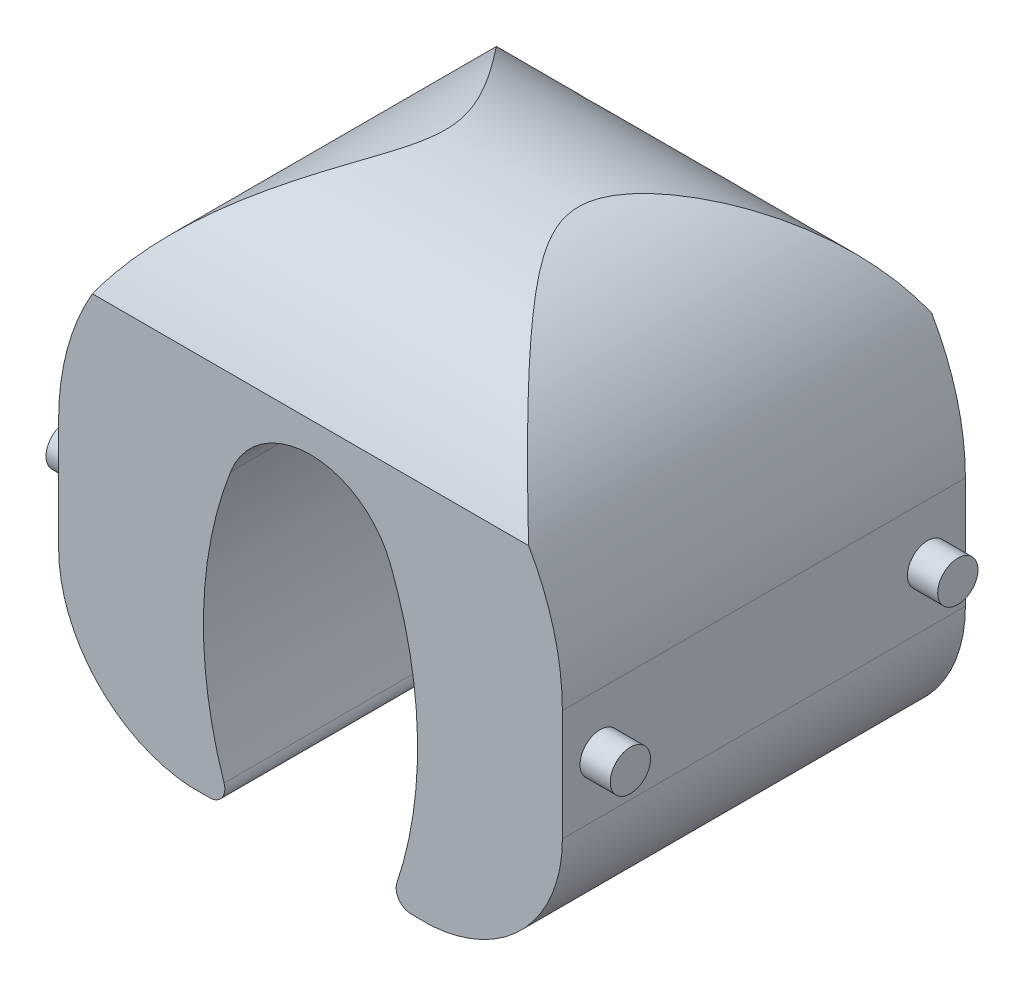
ISO-10303-21;
HEADER;
FILE_DESCRIPTION(('STEP AP214'),'2;1');
FILE_NAME('part.step','',(''),(''),'','','');
FILE_SCHEMA(('AUTOMOTIVE_DESIGN { 1 0 10303 214 1 1 1 1 }'));
ENDSEC;
DATA;
#1=APPLICATION_CONTEXT('core data for automotive mechanical design processes');
#2=APPLICATION_PROTOCOL_DEFINITION('international standard','automotive_design',2000,#1);
#3=PRODUCT_CONTEXT('',#1,'mechanical');
#4=PRODUCT('Part','Part','',(#3));
#5=PRODUCT_RELATED_PRODUCT_CATEGORY('part','',(#4));
#6=PRODUCT_DEFINITION_FORMATION('','',#4);
#7=PRODUCT_DEFINITION_CONTEXT('part definition',#1,'design');
#8=PRODUCT_DEFINITION('design','',#6,#7);
#9=PRODUCT_DEFINITION_SHAPE('','',#8);
#10=(LENGTH_UNIT() NAMED_UNIT(*) SI_UNIT(.MILLI.,.METRE.));
#11=(NAMED_UNIT(*) PLANE_ANGLE_UNIT() SI_UNIT($,.RADIAN.));
#12=(NAMED_UNIT(*) SI_UNIT($,.STERADIAN.) SOLID_ANGLE_UNIT());
#13=UNCERTAINTY_MEASURE_WITH_UNIT(LENGTH_MEASURE(1.E-05),#10,'distance_accuracy_value','');
#14=(GEOMETRIC_REPRESENTATION_CONTEXT(3) GLOBAL_UNCERTAINTY_ASSIGNED_CONTEXT((#13)) GLOBAL_UNIT_ASSIGNED_CONTEXT((#10,
#11,#12)) REPRESENTATION_CONTEXT('',''));
#15=CARTESIAN_POINT('',(0.,0.,0.));
#16=DIRECTION('',(0.,0.,1.));
#17=DIRECTION('',(1.,0.,0.));
#18=AXIS2_PLACEMENT_3D('',#15,#16,#17);
#19=CARTESIAN_POINT('',(0.,0.,-35.3553390593274));
#20=DIRECTION('',(0.,0.,1.));
#21=DIRECTION('',(1.,0.,0.));
#22=AXIS2_PLACEMENT_3D('',#19,#20,#21);
#23=CYLINDRICAL_SURFACE('',#22,25.);
#24=CARTESIAN_POINT('',(-21.650635094611,12.5,10.));
#25=CARTESIAN_POINT('',(-21.4703918887027,12.8122004030975,10.1679854247668));
#26=CARTESIAN_POINT('',(-21.2848264414583,13.1180055209978,10.342044413657));
#27=CARTESIAN_POINT('',(-20.9043958275241,13.7161056991821,10.7012859084175));
#28=CARTESIAN_POINT('',(-20.7095474527227,14.0084234018645,10.8864484751205));
#29=CARTESIAN_POINT('',(-20.3114243463407,14.5796837879489,11.2673071757743));
#30=CARTESIAN_POINT('',(-20.1081567166653,14.8586373326348,11.4629944717703));
#31=CARTESIAN_POINT('',(-19.6940313805674,15.4033160524039,11.8643222319061));
#32=CARTESIAN_POINT('',(-19.4831751193713,15.6690437235739,12.0699608034068));
#33=CARTESIAN_POINT('',(-19.0555450520767,16.1863647516528,12.4897826751679));
#34=CARTESIAN_POINT('',(-18.8387965942421,16.4380076864003,12.7039307822817));
#35=CARTESIAN_POINT('',(-18.3993892832232,16.9284052548925,13.1409722554456));
#36=CARTESIAN_POINT('',(-18.1767284439242,17.1671554738166,13.36386857257));
#37=CARTESIAN_POINT('',(-17.7263012157471,17.6318741285196,13.8178535965159));
#38=CARTESIAN_POINT('',(-17.4985334575103,17.8578390774432,14.0489445105173));
#39=CARTESIAN_POINT('',(-17.03871013725,18.2970887315882,14.5187715456033));
#40=CARTESIAN_POINT('',(-16.8066545293914,18.5103733011589,14.7575077484328));
#41=CARTESIAN_POINT('',(-16.2850388066385,18.9722229104713,15.2981079155009));
#42=CARTESIAN_POINT('',(-15.9945604410971,19.2175788516989,15.6018317271138));
#43=CARTESIAN_POINT('',(-15.4095501614136,19.6897705474217,16.2195543675952));
#44=CARTESIAN_POINT('',(-15.1150183002954,19.916606543908,16.5335530621318));
#45=CARTESIAN_POINT('',(-14.5231444741685,20.352231375241,17.1714610972733));
#46=CARTESIAN_POINT('',(-14.2258017546421,20.5610152024196,17.4953731543191));
#47=CARTESIAN_POINT('',(-13.6296829202574,20.9609304834307,18.1529011820612));
#48=CARTESIAN_POINT('',(-13.3309062956463,21.1520550810181,18.4865208562145));
#49=CARTESIAN_POINT('',(-12.7334517516284,21.5170114612812,19.163535537655));
#50=CARTESIAN_POINT('',(-12.4347739661514,21.690834122768,19.5069355795329));
#51=CARTESIAN_POINT('',(-11.8396264225496,22.0213322131252,20.2036187342451));
#52=CARTESIAN_POINT('',(-11.5431562409427,22.1780110140059,20.5568998863465));
#53=CARTESIAN_POINT('',(-10.9549209717684,22.474385583312,21.2740088675354));
#54=CARTESIAN_POINT('',(-10.663153262064,22.6140911218973,21.6378304785029));
#55=CARTESIAN_POINT('',(-10.231544981014,22.8109738078923,22.1925375880749));
#56=CARTESIAN_POINT('',(-10.0887220907965,22.8744726865351,22.3788820662297));
#57=CARTESIAN_POINT('',(-9.80562711684784,22.9972492083998,22.7548664342804));
#58=CARTESIAN_POINT('',(-9.6653549576173,23.0565269767146,22.9445062263121));
#59=CARTESIAN_POINT('',(-9.33691362873107,23.1918981193467,23.3979610558075));
#60=CARTESIAN_POINT('',(-9.15014593432757,23.2661368144741,23.6633537405048));
#61=CARTESIAN_POINT('',(-8.78489185634455,23.4064934890057,24.2019352793416));
#62=CARTESIAN_POINT('',(-8.60640594500256,23.4726110056835,24.4751245766228));
#63=CARTESIAN_POINT('',(-8.26109111771402,23.5963548095124,25.0302761520532));
#64=CARTESIAN_POINT('',(-8.09424990031941,23.6539901308802,25.3122287031034));
#65=CARTESIAN_POINT('',(-7.77650340737455,23.7603451432342,25.8866370211786));
#66=CARTESIAN_POINT('',(-7.62559259699334,23.8090679351135,26.1790890926297));
#67=CARTESIAN_POINT('',(-7.39306884914246,23.8820442533476,26.6754429808221));
#68=CARTESIAN_POINT('',(-7.30522751583676,23.9090140854946,26.8760190079123));
#69=CARTESIAN_POINT('',(-7.14167969006531,23.9583743142906,27.2827185563825));
#70=CARTESIAN_POINT('',(-7.06597565101045,23.9807637853254,27.4888431895381));
#71=CARTESIAN_POINT('',(-6.92961076346051,24.0205232899096,27.905944094508));
#72=CARTESIAN_POINT('',(-6.86891152452133,24.037906152329,28.1169064435605));
#73=CARTESIAN_POINT('',(-6.76518158481101,24.067306716289,28.5434214058895));
#74=CARTESIAN_POINT('',(-6.72213708903901,24.0793286074097,28.7589702962803));
#75=CARTESIAN_POINT('',(-6.66677972166269,24.0947000979095,29.1232883693034));
#76=CARTESIAN_POINT('',(-6.64903295077542,24.0995961122563,29.2711792952149));
#77=CARTESIAN_POINT('',(-6.62327901514937,24.1066870371467,29.5679023072381));
#78=CARTESIAN_POINT('',(-6.61527279621806,24.1088816853879,29.716734483335));
#79=CARTESIAN_POINT('',(-6.60926827480022,24.1105284464378,30.0145819627367));
#80=CARTESIAN_POINT('',(-6.61126771425763,24.1099811780365,30.163597217136));
#81=CARTESIAN_POINT('',(-6.62520639948125,24.1061546380479,30.4612201479509));
#82=CARTESIAN_POINT('',(-6.6371521502072,24.1028735785404,30.6098274937599));
#83=CARTESIAN_POINT('',(-6.67061882716548,24.093632846852,30.9059012379284));
#84=CARTESIAN_POINT('',(-6.69214182545638,24.0876725950191,31.0533673823585));
#85=CARTESIAN_POINT('',(-6.74412651410233,24.0731693111059,31.346572175449));
#86=CARTESIAN_POINT('',(-6.77458873237055,24.0646261264875,31.4923107215559));
#87=CARTESIAN_POINT('',(-6.87198975398282,24.0370554551266,31.9002719019654));
#88=CARTESIAN_POINT('',(-6.94836323598113,24.0151735321961,32.1600775836541));
#89=CARTESIAN_POINT('',(-7.12283619094969,23.9640026450687,32.6714317547063));
#90=CARTESIAN_POINT('',(-7.22094432203508,23.9347107283991,32.9229769074623));
#91=CARTESIAN_POINT('',(-7.43448142943967,23.8692482739429,33.4189936782992));
#92=CARTESIAN_POINT('',(-7.54998886441725,23.8330463686048,33.6634269435673));
#93=CARTESIAN_POINT('',(-7.7939515314641,23.7543836221868,34.1445951402686));
#94=CARTESIAN_POINT('',(-7.92240528383557,23.7119234961337,34.3813309474006));
#95=CARTESIAN_POINT('',(-8.15126746077332,23.6340227936245,34.7816343329988));
#96=CARTESIAN_POINT('',(-8.24926986092707,23.6000172615012,34.9468734222187));
#97=CARTESIAN_POINT('',(-8.44946913232327,23.5290832607685,35.274158890423));
#98=CARTESIAN_POINT('',(-8.55166624534758,23.4921546235582,35.436205084571));
#99=CARTESIAN_POINT('',(-8.86359886487004,23.3770329497007,35.91825840609));
#100=CARTESIAN_POINT('',(-9.07851338459992,23.2945587623321,36.2339019815986));
#101=CARTESIAN_POINT('',(-9.5179676919932,23.1184878071047,36.8557139182407));
#102=CARTESIAN_POINT('',(-9.74251834423334,23.0248782618574,37.161870876307));
#103=CARTESIAN_POINT('',(-10.1981196665355,22.8267406379357,37.765798733985));
#104=CARTESIAN_POINT('',(-10.4291718490069,22.7222100031568,38.063567649559));
#105=CARTESIAN_POINT('',(-10.8962885745889,22.5019510003868,38.6524955322819));
#106=CARTESIAN_POINT('',(-11.1323661522503,22.3861897554257,38.9436318111286));
#107=CARTESIAN_POINT('',(-11.6070433616396,22.1437917737761,39.518761824573));
#108=CARTESIAN_POINT('',(-11.8456405954942,22.0171646807473,39.8027616093277));
#109=CARTESIAN_POINT('',(-12.3242128372816,21.7528956921303,40.3641707608433));
#110=CARTESIAN_POINT('',(-12.564187220842,21.6152584705892,40.6415828600408));
#111=CARTESIAN_POINT('',(-13.0445884657629,21.3287819521825,41.1901416774372));
#112=CARTESIAN_POINT('',(-13.2850153195066,21.1799428422724,41.4612885001026));
#113=CARTESIAN_POINT('',(-13.8646470920954,20.807075629001,42.1080790349915));
#114=CARTESIAN_POINT('',(-14.2036544081563,20.577373952853,42.4806503793503));
#115=CARTESIAN_POINT('',(-14.8787750975945,20.0946347764815,43.2133177049096));
#116=CARTESIAN_POINT('',(-15.214887644119,19.8415908357412,43.5734102050615));
#117=CARTESIAN_POINT('',(-15.8822419170561,19.3115512229187,44.2805016743851));
#118=CARTESIAN_POINT('',(-16.2134823651142,19.034549391392,44.6274972432733));
#119=CARTESIAN_POINT('',(-16.8674034606367,18.4575164036212,45.3056635058733));
#120=CARTESIAN_POINT('',(-17.1901186525971,18.1576074494056,45.6369047114866));
#121=CARTESIAN_POINT('',(-17.8266551978411,17.5330853028519,46.2841624818673));
#122=CARTESIAN_POINT('',(-18.1404785554621,17.2084777396951,46.600182489119));
#123=CARTESIAN_POINT('',(-18.7570007695802,16.5343143709141,47.2154669536529));
#124=CARTESIAN_POINT('',(-19.059705444701,16.1847719043322,47.5147402190263));
#125=CARTESIAN_POINT('',(-19.767789615777,15.3185437730352,48.2086676375783));
#126=CARTESIAN_POINT('',(-20.1670613000592,14.7899244077552,48.59488747896));
#127=CARTESIAN_POINT('',(-20.7422488157644,13.959693540469,49.1446611549999));
#128=CARTESIAN_POINT('',(-20.9303060745223,13.6762500420653,49.3232546398174));
#129=CARTESIAN_POINT('',(-21.2974339565751,13.0972064374575,49.6697790007761));
#130=CARTESIAN_POINT('',(-21.4765030730937,12.8016043079873,49.8377080903762));
#131=CARTESIAN_POINT('',(-21.6506350946109,12.5,50.));
#132=B_SPLINE_CURVE_WITH_KNOTS('',3,(#24,#25,#26,#27,#28,#29,#30,#31,#32,#33,#34,#35,#36,#37,
#38,#39,#40,#41,#42,#43,#44,#45,#46,#47,#48,#49,#50,#51,#52,#53,#54,#55,#56,#57,#58,#59,#60,#61,
#62,#63,#64,#65,#66,#67,#68,#69,#70,#71,#72,#73,#74,#75,#76,#77,#78,#79,#80,#81,#82,#83,#84,#85,
#86,#87,#88,#89,#90,#91,#92,#93,#94,#95,#96,#97,#98,#99,#100,#101,#102,#103,#104,#105,#106,#107,
#108,#109,#110,#111,#112,#113,#114,#115,#116,#117,#118,#119,#120,#121,#122,#123,#124,#125,#126,
#127,#128,#129,#130,#131),.UNSPECIFIED.,.F.,.F.,(4,2,2,2,2,2,2,2,2,2,2,2,2,2,2,2,2,2,2,2,2,2,2,
2,2,2,2,2,2,2,2,2,2,2,2,2,2,2,2,2,2,2,2,2,2,2,2,2,2,2,2,2,2,4),(0.,1.19294408488821,
2.38380662307587,3.5736843117174,4.76333657945519,5.94849716558414,7.13406104283828,
8.31994670906992,9.50584505924321,10.9652694174802,12.4246747030782,13.8844835371932,
15.3448567852578,16.805995876284,18.2668470586163,19.7268533202357,20.4564461408719,
21.186017330939,22.1844835110307,23.1830065551117,24.1804582735959,25.1775622907189,
25.8390676582253,26.5007065731094,27.1606347148178,27.8200462173023,28.2668314611609,
28.7136600843997,29.1603878728373,29.6074080541888,30.0545249963992,30.5016683487936,
31.3152476282981,32.1291515861502,32.9468420858647,33.7644392334975,34.3496508512965,
34.9348962479992,36.106365803916,37.2791927826694,38.4522948816609,39.6289412119305,
40.804553837136,41.9796700102418,43.1547665754335,44.8149845847804,46.4756620537794,
48.1367677503844,49.789559525712,51.4419757270549,53.0935144954536,55.3905075296122,
56.5426921094914,57.695069201403),.UNSPECIFIED.);
#133=CARTESIAN_POINT('',(-21.650635094611,12.5,10.));
#134=VERTEX_POINT('',#133);
#135=CARTESIAN_POINT('',(-21.650635094611,12.5,50.));
#136=VERTEX_POINT('',#135);
#137=EDGE_CURVE('E337',#134,#136,#132,.T.);
#138=ORIENTED_EDGE('',*,*,#137,.F.);
#139=CARTESIAN_POINT('',(0.,0.,9.99999999999999));
#140=DIRECTION('',(0.,0.,-1.));
#141=DIRECTION('',(-1.,0.,0.));
#142=AXIS2_PLACEMENT_3D('',#139,#140,#141);
#143=CIRCLE('',#142,25.);
#144=CARTESIAN_POINT('',(-25.,0.,9.99999999999999));
#145=VERTEX_POINT('',#144);
#146=EDGE_CURVE('E317',#145,#134,#143,.T.);
#147=ORIENTED_EDGE('',*,*,#146,.F.);
#148=DIRECTION('',(0.,0.,1.));
#149=VECTOR('',#148,1.);
#150=CARTESIAN_POINT('',(-25.,0.,-35.3553390593274));
#151=LINE('',#150,#149);
#152=CARTESIAN_POINT('',(-25.,0.,50.0000000000001));
#153=VERTEX_POINT('',#152);
#154=EDGE_CURVE('E238',#145,#153,#151,.T.);
#155=ORIENTED_EDGE('',*,*,#154,.T.);
#156=CARTESIAN_POINT('',(0.,0.,50.0000000000001));
#157=DIRECTION('',(0.,0.,1.));
#158=DIRECTION('',(1.,0.,0.));
#159=AXIS2_PLACEMENT_3D('',#156,#157,#158);
#160=CIRCLE('',#159,25.);
#161=EDGE_CURVE('E389',#136,#153,#160,.T.);
#162=ORIENTED_EDGE('',*,*,#161,.F.);
#163=EDGE_LOOP('',(#138,#147,#155,#162));
#164=FACE_BOUND('',#163,.T.);
#165=ADVANCED_FACE('F75',(#164),#23,.T.);
#166=CARTESIAN_POINT('',(21.650635094611,12.5,10.));
#167=CARTESIAN_POINT('',(21.4703918887027,12.8122004030975,10.1679854247668));
#168=CARTESIAN_POINT('',(21.2848264414583,13.1180055209978,10.342044413657));
#169=CARTESIAN_POINT('',(20.9043958275241,13.7161056991821,10.7012859084175));
#170=CARTESIAN_POINT('',(20.7095474527227,14.0084234018645,10.8864484751205));
#171=CARTESIAN_POINT('',(20.3114243463407,14.5796837879489,11.2673071757743));
#172=CARTESIAN_POINT('',(20.1081567166653,14.8586373326348,11.4629944717703));
#173=CARTESIAN_POINT('',(19.6940313805674,15.4033160524039,11.8643222319061));
#174=CARTESIAN_POINT('',(19.4831751193713,15.6690437235739,12.0699608034068));
#175=CARTESIAN_POINT('',(19.0555450520767,16.1863647516528,12.4897826751679));
#176=CARTESIAN_POINT('',(18.8387965942421,16.4380076864003,12.7039307822817));
#177=CARTESIAN_POINT('',(18.3993892832232,16.9284052548925,13.1409722554456));
#178=CARTESIAN_POINT('',(18.1767284439242,17.1671554738166,13.3638685725701));
#179=CARTESIAN_POINT('',(17.7263012157471,17.6318741285196,13.817853596516));
#180=CARTESIAN_POINT('',(17.4985334575103,17.8578390774433,14.0489445105173));
#181=CARTESIAN_POINT('',(17.03871013725,18.2970887315882,14.5187715456034));
#182=CARTESIAN_POINT('',(16.8066545293914,18.5103733011589,14.7575077484329));
#183=CARTESIAN_POINT('',(16.2850388066385,18.9722229104714,15.298107915501));
#184=CARTESIAN_POINT('',(15.9945604410971,19.2175788516989,15.6018317271138));
#185=CARTESIAN_POINT('',(15.4095501614136,19.6897705474217,16.2195543675952));
#186=CARTESIAN_POINT('',(15.1150183002954,19.916606543908,16.5335530621318));
#187=CARTESIAN_POINT('',(14.5231444741685,20.352231375241,17.1714610972733));
#188=CARTESIAN_POINT('',(14.2258017546421,20.5610152024196,17.4953731543191));
#189=CARTESIAN_POINT('',(13.6296829202574,20.9609304834307,18.1529011820612));
#190=CARTESIAN_POINT('',(13.3309062956463,21.1520550810181,18.4865208562145));
#191=CARTESIAN_POINT('',(12.7334517516285,21.5170114612812,19.163535537655));
#192=CARTESIAN_POINT('',(12.4347739661515,21.690834122768,19.5069355795329));
#193=CARTESIAN_POINT('',(11.8396264225496,22.0213322131252,20.2036187342451));
#194=CARTESIAN_POINT('',(11.5431562409427,22.1780110140059,20.5568998863466));
#195=CARTESIAN_POINT('',(10.9549209717684,22.474385583312,21.2740088675354));
#196=CARTESIAN_POINT('',(10.663153262064,22.6140911218973,21.6378304785029));
#197=CARTESIAN_POINT('',(10.231544981014,22.8109738078923,22.1925375880749));
#198=CARTESIAN_POINT('',(10.0887220907965,22.8744726865351,22.3788820662297));
#199=CARTESIAN_POINT('',(9.80562711684786,22.9972492083998,22.7548664342805));
#200=CARTESIAN_POINT('',(9.66535495761731,23.0565269767146,22.9445062263121));
#201=CARTESIAN_POINT('',(9.33691362873109,23.1918981193467,23.3979610558075));
#202=CARTESIAN_POINT('',(9.15014593432761,23.2661368144741,23.6633537405048));
#203=CARTESIAN_POINT('',(8.78489185634459,23.4064934890057,24.2019352793416));
#204=CARTESIAN_POINT('',(8.60640594500259,23.4726110056835,24.4751245766228));
#205=CARTESIAN_POINT('',(8.26109111771405,23.5963548095124,25.0302761520532));
#206=CARTESIAN_POINT('',(8.09424990031944,23.6539901308802,25.3122287031034));
#207=CARTESIAN_POINT('',(7.77650340737459,23.7603451432342,25.8866370211786));
#208=CARTESIAN_POINT('',(7.62559259699337,23.8090679351135,26.1790890926296));
#209=CARTESIAN_POINT('',(7.39306884914249,23.8820442533476,26.675442980822));
#210=CARTESIAN_POINT('',(7.30522751583679,23.9090140854946,26.8760190079123));
#211=CARTESIAN_POINT('',(7.14167969006535,23.9583743142906,27.2827185563825));
#212=CARTESIAN_POINT('',(7.06597565101049,23.9807637853254,27.4888431895381));
#213=CARTESIAN_POINT('',(6.92961076346054,24.0205232899096,27.905944094508));
#214=CARTESIAN_POINT('',(6.86891152452135,24.037906152329,28.1169064435605));
#215=CARTESIAN_POINT('',(6.76518158481103,24.067306716289,28.5434214058894));
#216=CARTESIAN_POINT('',(6.72213708903903,24.0793286074097,28.7589702962803));
#217=CARTESIAN_POINT('',(6.6667797216627,24.0947000979095,29.1232883693034));
#218=CARTESIAN_POINT('',(6.64903295077544,24.0995961122563,29.2711792952149));
#219=CARTESIAN_POINT('',(6.6232790151494,24.1066870371467,29.5679023072381));
#220=CARTESIAN_POINT('',(6.61527279621809,24.1088816853879,29.716734483335));
#221=CARTESIAN_POINT('',(6.60926827480024,24.1105284464378,30.0145819627366));
#222=CARTESIAN_POINT('',(6.61126771425764,24.1099811780365,30.163597217136));
#223=CARTESIAN_POINT('',(6.62520639948124,24.1061546380479,30.4612201479508));
#224=CARTESIAN_POINT('',(6.6371521502072,24.1028735785404,30.6098274937599));
#225=CARTESIAN_POINT('',(6.67061882716549,24.093632846852,30.9059012379284));
#226=CARTESIAN_POINT('',(6.6921418254564,24.0876725950191,31.0533673823584));
#227=CARTESIAN_POINT('',(6.74412651410233,24.0731693111059,31.346572175449));
#228=CARTESIAN_POINT('',(6.77458873237052,24.0646261264875,31.4923107215558));
#229=CARTESIAN_POINT('',(6.87198975398276,24.0370554551266,31.9002719019654));
#230=CARTESIAN_POINT('',(6.94836323598112,24.0151735321961,32.160077583654));
#231=CARTESIAN_POINT('',(7.1228361909497,23.9640026450687,32.6714317547062));
#232=CARTESIAN_POINT('',(7.22094432203507,23.9347107283991,32.9229769074622));
#233=CARTESIAN_POINT('',(7.43448142943963,23.8692482739429,33.4189936782992));
#234=CARTESIAN_POINT('',(7.54998886441721,23.8330463686048,33.6634269435672));
#235=CARTESIAN_POINT('',(7.79395153146406,23.7543836221868,34.1445951402686));
#236=CARTESIAN_POINT('',(7.92240528383552,23.7119234961337,34.3813309474005));
#237=CARTESIAN_POINT('',(8.15126746077328,23.6340227936245,34.7816343329987));
#238=CARTESIAN_POINT('',(8.24926986092705,23.6000172615012,34.9468734222187));
#239=CARTESIAN_POINT('',(8.44946913232326,23.5290832607685,35.274158890423));
#240=CARTESIAN_POINT('',(8.55166624534756,23.4921546235582,35.4362050845709));
#241=CARTESIAN_POINT('',(8.86359886487,23.3770329497008,35.9182584060899));
#242=CARTESIAN_POINT('',(9.07851338459989,23.2945587623321,36.2339019815985));
#243=CARTESIAN_POINT('',(9.51796769199319,23.1184878071047,36.8557139182406));
#244=CARTESIAN_POINT('',(9.74251834423331,23.0248782618574,37.161870876307));
#245=CARTESIAN_POINT('',(10.1981196665354,22.8267406379357,37.765798733985));
#246=CARTESIAN_POINT('',(10.4291718490068,22.7222100031569,38.0635676495589));
#247=CARTESIAN_POINT('',(10.8962885745888,22.5019510003869,38.6524955322818));
#248=CARTESIAN_POINT('',(11.1323661522502,22.3861897554258,38.9436318111285));
#249=CARTESIAN_POINT('',(11.6070433616395,22.1437917737761,39.5187618245729));
#250=CARTESIAN_POINT('',(11.8456405954941,22.0171646807474,39.8027616093276));
#251=CARTESIAN_POINT('',(12.3242128372816,21.7528956921303,40.3641707608432));
#252=CARTESIAN_POINT('',(12.5641872208419,21.6152584705892,40.6415828600407));
#253=CARTESIAN_POINT('',(13.0445884657628,21.3287819521826,41.1901416774371));
#254=CARTESIAN_POINT('',(13.2850153195065,21.1799428422725,41.4612885001025));
#255=CARTESIAN_POINT('',(13.8646470920953,20.8070756290011,42.1080790349915));
#256=CARTESIAN_POINT('',(14.2036544081562,20.577373952853,42.4806503793502));
#257=CARTESIAN_POINT('',(14.8787750975944,20.0946347764816,43.2133177049096));
#258=CARTESIAN_POINT('',(15.2148876441189,19.8415908357413,43.5734102050614));
#259=CARTESIAN_POINT('',(15.882241917056,19.3115512229187,44.280501674385));
#260=CARTESIAN_POINT('',(16.2134823651141,19.0345493913921,44.6274972432732));
#261=CARTESIAN_POINT('',(16.8674034606366,18.4575164036213,45.3056635058732));
#262=CARTESIAN_POINT('',(17.190118652597,18.1576074494057,45.6369047114865));
#263=CARTESIAN_POINT('',(17.8266551978409,17.533085302852,46.2841624818672));
#264=CARTESIAN_POINT('',(18.140478555462,17.2084777396952,46.6001824891189));
#265=CARTESIAN_POINT('',(18.7570007695801,16.5343143709142,47.2154669536528));
#266=CARTESIAN_POINT('',(19.0597054447009,16.1847719043324,47.5147402190261));
#267=CARTESIAN_POINT('',(19.7677896157769,15.3185437730353,48.2086676375781));
#268=CARTESIAN_POINT('',(20.1670613000591,14.7899244077553,48.59488747896));
#269=CARTESIAN_POINT('',(20.7422488157643,13.9596935404691,49.1446611549999));
#270=CARTESIAN_POINT('',(20.9303060745222,13.6762500420653,49.3232546398174));
#271=CARTESIAN_POINT('',(21.2974339565751,13.0972064374575,49.6697790007761));
#272=CARTESIAN_POINT('',(21.4765030730937,12.8016043079873,49.8377080903762));
#273=CARTESIAN_POINT('',(21.6506350946109,12.5,50.));
#274=B_SPLINE_CURVE_WITH_KNOTS('',3,(#166,#167,#168,#169,#170,#171,#172,#173,#174,#175,#176,
#177,#178,#179,#180,#181,#182,#183,#184,#185,#186,#187,#188,#189,#190,#191,#192,#193,#194,#195,
#196,#197,#198,#199,#200,#201,#202,#203,#204,#205,#206,#207,#208,#209,#210,#211,#212,#213,#214,
#215,#216,#217,#218,#219,#220,#221,#222,#223,#224,#225,#226,#227,#228,#229,#230,#231,#232,#233,
#234,#235,#236,#237,#238,#239,#240,#241,#242,#243,#244,#245,#246,#247,#248,#249,#250,#251,#252,
#253,#254,#255,#256,#257,#258,#259,#260,#261,#262,#263,#264,#265,#266,#267,#268,#269,#270,#271,
#272,#273),.UNSPECIFIED.,.F.,.F.,(4,2,2,2,2,2,2,2,2,2,2,2,2,2,2,2,2,2,2,2,2,2,2,2,2,2,2,2,2,2,2,
2,2,2,2,2,2,2,2,2,2,2,2,2,2,2,2,2,2,2,2,2,2,4),(0.,1.19294408488821,2.38380662307588,
3.57368431171742,4.76333657945522,5.94849716558416,7.13406104283831,8.31994670906994,
9.50584505924324,10.9652694174802,12.4246747030782,13.8844835371932,15.3448567852578,
16.805995876284,18.2668470586163,19.7268533202357,20.4564461408719,21.186017330939,
22.1844835110307,23.1830065551117,24.1804582735959,25.1775622907189,25.8390676582252,
26.5007065731094,27.1606347148178,27.8200462173023,28.2668314611609,28.7136600843997,
29.1603878728372,29.6074080541888,30.0545249963991,30.5016683487935,31.315247628298,
32.12915158615,32.9468420858646,33.7644392334974,34.3496508512964,34.9348962479991,
36.1063658039159,37.2791927826692,38.4522948816608,39.6289412119304,40.8045538371358,
41.9796700102416,43.1547665754334,44.8149845847802,46.4756620537792,48.1367677503842,
49.7895595257118,51.4419757270546,53.0935144954533,55.3905075296121,56.5426921094913,
57.6950692014029),.UNSPECIFIED.);
#275=CARTESIAN_POINT('',(21.650635094611,12.5,10.));
#276=VERTEX_POINT('',#275);
#277=CARTESIAN_POINT('',(21.650635094611,12.5,50.));
#278=VERTEX_POINT('',#277);
#279=EDGE_CURVE('E91',#276,#278,#274,.T.);
#280=ORIENTED_EDGE('',*,*,#279,.T.);
#281=CARTESIAN_POINT('',(25.,0.,50.0000000000001));
#282=VERTEX_POINT('',#281);
#283=EDGE_CURVE('E292',#282,#278,#160,.T.);
#284=ORIENTED_EDGE('',*,*,#283,.F.);
#285=DIRECTION('',(0.,0.,1.));
#286=VECTOR('',#285,1.);
#287=CARTESIAN_POINT('',(25.,0.,-35.3553390593274));
#288=LINE('',#287,#286);
#289=CARTESIAN_POINT('',(25.,0.,9.99999999999999));
#290=VERTEX_POINT('',#289);
#291=EDGE_CURVE('E234',#290,#282,#288,.T.);
#292=ORIENTED_EDGE('',*,*,#291,.F.);
#293=EDGE_CURVE('E273',#276,#290,#143,.T.);
#294=ORIENTED_EDGE('',*,*,#293,.F.);
#295=EDGE_LOOP('',(#280,#284,#292,#294));
#296=FACE_BOUND('',#295,.T.);
#297=ADVANCED_FACE('F409',(#296),#23,.T.);
#298=CARTESIAN_POINT('',(0.,0.,50.0000000000001));
#299=DIRECTION('',(0.,0.,1.));
#300=DIRECTION('',(1.,0.,0.));
#301=AXIS2_PLACEMENT_3D('',#298,#299,#300);
#302=PLANE('',#301);
#303=CARTESIAN_POINT('',(0.,0.999999999999987,50.));
#304=DIRECTION('',(0.,0.,1.));
#305=DIRECTION('',(1.,0.,0.));
#306=AXIS2_PLACEMENT_3D('',#303,#304,#305);
#307=CIRCLE('',#306,8.5);
#308=CARTESIAN_POINT('',(7.92577262040183,4.07117703327056,50.0000000000001));
#309=VERTEX_POINT('',#308);
#310=CARTESIAN_POINT('',(-7.92577262040184,4.07117703327056,50.0000000000001));
#311=VERTEX_POINT('',#310);
#312=EDGE_CURVE('E183',#309,#311,#307,.T.);
#313=ORIENTED_EDGE('',*,*,#312,.F.);
#314=CARTESIAN_POINT('',(-29.3719808873715,-10.3814207703557,50.0000000000001));
#315=DIRECTION('',(0.,0.,1.));
#316=DIRECTION('',(1.,0.,0.));
#317=AXIS2_PLACEMENT_3D('',#314,#315,#316);
#318=CIRCLE('',#317,40.);
#319=CARTESIAN_POINT('',(8.5769163534685,-23.0258344856755,50.0000000000001));
#320=VERTEX_POINT('',#319);
#321=EDGE_CURVE('E385',#309,#320,#318,.F.);
#322=ORIENTED_EDGE('',*,*,#321,.T.);
#323=CARTESIAN_POINT('',(10.,-23.5,50.0000000000001));
#324=DIRECTION('',(0.,0.,1.));
#325=DIRECTION('',(1.,0.,0.));
#326=AXIS2_PLACEMENT_3D('',#323,#324,#325);
#327=CIRCLE('',#326,1.5);
#328=CARTESIAN_POINT('',(9.99999999999999,-25.,50.0000000000001));
#329=VERTEX_POINT('',#328);
#330=EDGE_CURVE('E390',#320,#329,#327,.T.);
#331=ORIENTED_EDGE('',*,*,#330,.T.);
#332=DIRECTION('',(1.,0.,0.));
#333=VECTOR('',#332,1.);
#334=CARTESIAN_POINT('',(-25.,-25.,50.0000000000001));
#335=LINE('',#334,#333);
#336=CARTESIAN_POINT('',(12.,-25.,50.0000000000001));
#337=VERTEX_POINT('',#336);
#338=EDGE_CURVE('E395',#329,#337,#335,.T.);
#339=ORIENTED_EDGE('',*,*,#338,.T.);
#340=CARTESIAN_POINT('',(11.,-11.0357599562311,50.0000000000001));
#341=DIRECTION('',(0.,0.,1.));
#342=DIRECTION('',(1.,0.,0.));
#343=AXIS2_PLACEMENT_3D('',#340,#341,#342);
#344=CIRCLE('',#343,14.);
#345=CARTESIAN_POINT('',(25.,-11.0357599562311,50.0000000000001));
#346=VERTEX_POINT('',#345);
#347=EDGE_CURVE('E242',#337,#346,#344,.T.);
#348=ORIENTED_EDGE('',*,*,#347,.T.);
#349=DIRECTION('',(0.,1.,0.));
#350=VECTOR('',#349,1.);
#351=CARTESIAN_POINT('',(25.,-25.,50.0000000000001));
#352=LINE('',#351,#350);
#353=EDGE_CURVE('E406',#346,#282,#352,.T.);
#354=ORIENTED_EDGE('',*,*,#353,.T.);
#355=ORIENTED_EDGE('',*,*,#283,.T.);
#356=DIRECTION('',(-1.,0.,0.));
#357=VECTOR('',#356,1.);
#358=CARTESIAN_POINT('',(48.0456403483627,12.5,50.0000000000001));
#359=LINE('',#358,#357);
#360=EDGE_CURVE('E364',#278,#136,#359,.T.);
#361=ORIENTED_EDGE('',*,*,#360,.T.);
#362=ORIENTED_EDGE('',*,*,#161,.T.);
#363=DIRECTION('',(0.,-1.,0.));
#364=VECTOR('',#363,1.);
#365=CARTESIAN_POINT('',(-25.,-25.,50.0000000000001));
#366=LINE('',#365,#364);
#367=CARTESIAN_POINT('',(-25.,-11.0357599562311,50.0000000000001));
#368=VERTEX_POINT('',#367);
#369=EDGE_CURVE('E286',#153,#368,#366,.T.);
#370=ORIENTED_EDGE('',*,*,#369,.T.);
#371=CARTESIAN_POINT('',(-11.,-11.0357599562311,50.0000000000001));
#372=DIRECTION('',(0.,0.,1.));
#373=DIRECTION('',(1.,0.,0.));
#374=AXIS2_PLACEMENT_3D('',#371,#372,#373);
#375=CIRCLE('',#374,14.);
#376=CARTESIAN_POINT('',(-12.,-25.,50.0000000000001));
#377=VERTEX_POINT('',#376);
#378=EDGE_CURVE('E282',#377,#368,#375,.F.);
#379=ORIENTED_EDGE('',*,*,#378,.F.);
#380=DIRECTION('',(1.,0.,0.));
#381=VECTOR('',#380,1.);
#382=CARTESIAN_POINT('',(-25.,-25.,50.0000000000001));
#383=LINE('',#382,#381);
#384=CARTESIAN_POINT('',(-10.,-25.,50.0000000000001));
#385=VERTEX_POINT('',#384);
#386=EDGE_CURVE('E285',#377,#385,#383,.T.);
#387=ORIENTED_EDGE('',*,*,#386,.T.);
#388=CARTESIAN_POINT('',(-10.,-23.5,50.0000000000001));
#389=DIRECTION('',(0.,0.,1.));
#390=DIRECTION('',(1.,0.,0.));
#391=AXIS2_PLACEMENT_3D('',#388,#389,#390);
#392=CIRCLE('',#391,1.5);
#393=CARTESIAN_POINT('',(-8.5769163534685,-23.0258344856755,50.0000000000001));
#394=VERTEX_POINT('',#393);
#395=EDGE_CURVE('E186',#394,#385,#392,.F.);
#396=ORIENTED_EDGE('',*,*,#395,.F.);
#397=CARTESIAN_POINT('',(29.3719808873715,-10.3814207703557,50.0000000000001));
#398=DIRECTION('',(0.,0.,1.));
#399=DIRECTION('',(1.,0.,0.));
#400=AXIS2_PLACEMENT_3D('',#397,#398,#399);
#401=CIRCLE('',#400,40.);
#402=EDGE_CURVE('E178',#311,#394,#401,.T.);
#403=ORIENTED_EDGE('',*,*,#402,.F.);
#404=EDGE_LOOP('',(#313,#322,#331,#339,#348,#354,#355,#361,#362,#370,#379,#387,#396,#403));
#405=FACE_BOUND('',#404,.T.);
#406=ADVANCED_FACE('F180',(#405),#302,.T.);
#407=CARTESIAN_POINT('',(0.,0.,9.99999999999999));
#408=DIRECTION('',(0.,0.,-1.));
#409=DIRECTION('',(-1.,0.,0.));
#410=AXIS2_PLACEMENT_3D('',#407,#408,#409);
#411=PLANE('',#410);
#412=CARTESIAN_POINT('',(0.,0.999999999999987,9.99999999999998));
#413=DIRECTION('',(0.,0.,-1.));
#414=DIRECTION('',(-1.,0.,0.));
#415=AXIS2_PLACEMENT_3D('',#412,#413,#414);
#416=CIRCLE('',#415,8.5);
#417=CARTESIAN_POINT('',(7.92577262040184,4.07117703327058,10.));
#418=VERTEX_POINT('',#417);
#419=CARTESIAN_POINT('',(-7.92577262040183,4.07117703327059,10.));
#420=VERTEX_POINT('',#419);
#421=EDGE_CURVE('E310',#418,#420,#416,.F.);
#422=ORIENTED_EDGE('',*,*,#421,.T.);
#423=CARTESIAN_POINT('',(29.3719808873715,-10.3814207703557,9.99999999999999));
#424=DIRECTION('',(0.,0.,-1.));
#425=DIRECTION('',(-1.,0.,0.));
#426=AXIS2_PLACEMENT_3D('',#423,#424,#425);
#427=CIRCLE('',#426,40.);
#428=CARTESIAN_POINT('',(-8.5769163534685,-23.0258344856756,9.99999999999999));
#429=VERTEX_POINT('',#428);
#430=EDGE_CURVE('E195',#420,#429,#427,.F.);
#431=ORIENTED_EDGE('',*,*,#430,.T.);
#432=CARTESIAN_POINT('',(-10.,-23.5,10.));
#433=DIRECTION('',(0.,0.,-1.));
#434=DIRECTION('',(-1.,0.,0.));
#435=AXIS2_PLACEMENT_3D('',#432,#433,#434);
#436=CIRCLE('',#435,1.5);
#437=CARTESIAN_POINT('',(-9.99999999999998,-25.,10.));
#438=VERTEX_POINT('',#437);
#439=EDGE_CURVE('E301',#429,#438,#436,.T.);
#440=ORIENTED_EDGE('',*,*,#439,.T.);
#441=DIRECTION('',(-1.,0.,0.));
#442=VECTOR('',#441,1.);
#443=CARTESIAN_POINT('',(0.,-25.,10.));
#444=LINE('',#443,#442);
#445=CARTESIAN_POINT('',(-12.,-25.,10.));
#446=VERTEX_POINT('',#445);
#447=EDGE_CURVE('E304',#438,#446,#444,.T.);
#448=ORIENTED_EDGE('',*,*,#447,.T.);
#449=CARTESIAN_POINT('',(-11.,-11.0357599562311,10.));
#450=DIRECTION('',(0.,0.,-1.));
#451=DIRECTION('',(-1.,0.,0.));
#452=AXIS2_PLACEMENT_3D('',#449,#450,#451);
#453=CIRCLE('',#452,14.);
#454=CARTESIAN_POINT('',(-25.,-11.0357599562311,10.));
#455=VERTEX_POINT('',#454);
#456=EDGE_CURVE('E274',#446,#455,#453,.T.);
#457=ORIENTED_EDGE('',*,*,#456,.T.);
#458=DIRECTION('',(0.,1.,0.));
#459=VECTOR('',#458,1.);
#460=CARTESIAN_POINT('',(-25.,0.,9.99999999999999));
#461=LINE('',#460,#459);
#462=EDGE_CURVE('E266',#455,#145,#461,.T.);
#463=ORIENTED_EDGE('',*,*,#462,.T.);
#464=ORIENTED_EDGE('',*,*,#146,.T.);
#465=DIRECTION('',(-1.,0.,0.));
#466=VECTOR('',#465,1.);
#467=CARTESIAN_POINT('',(48.0456403483627,12.5,10.));
#468=LINE('',#467,#466);
#469=EDGE_CURVE('E375',#276,#134,#468,.T.);
#470=ORIENTED_EDGE('',*,*,#469,.F.);
#471=ORIENTED_EDGE('',*,*,#293,.T.);
#472=DIRECTION('',(0.,-1.,0.));
#473=VECTOR('',#472,1.);
#474=CARTESIAN_POINT('',(25.,0.,9.99999999999999));
#475=LINE('',#474,#473);
#476=CARTESIAN_POINT('',(25.,-11.0357599562311,10.));
#477=VERTEX_POINT('',#476);
#478=EDGE_CURVE('E99',#290,#477,#475,.T.);
#479=ORIENTED_EDGE('',*,*,#478,.T.);
#480=CARTESIAN_POINT('',(11.,-11.0357599562311,10.));
#481=DIRECTION('',(0.,0.,-1.));
#482=DIRECTION('',(-1.,0.,0.));
#483=AXIS2_PLACEMENT_3D('',#480,#481,#482);
#484=CIRCLE('',#483,14.);
#485=CARTESIAN_POINT('',(12.,-25.,10.));
#486=VERTEX_POINT('',#485);
#487=EDGE_CURVE('E416',#477,#486,#484,.T.);
#488=ORIENTED_EDGE('',*,*,#487,.T.);
#489=DIRECTION('',(-1.,0.,0.));
#490=VECTOR('',#489,1.);
#491=CARTESIAN_POINT('',(0.,-25.,10.));
#492=LINE('',#491,#490);
#493=CARTESIAN_POINT('',(10.,-25.,10.));
#494=VERTEX_POINT('',#493);
#495=EDGE_CURVE('E419',#486,#494,#492,.T.);
#496=ORIENTED_EDGE('',*,*,#495,.T.);
#497=CARTESIAN_POINT('',(10.,-23.5,10.));
#498=DIRECTION('',(0.,0.,-1.));
#499=DIRECTION('',(-1.,0.,0.));
#500=AXIS2_PLACEMENT_3D('',#497,#498,#499);
#501=CIRCLE('',#500,1.5);
#502=CARTESIAN_POINT('',(8.5769163534685,-23.0258344856755,9.99999999999999));
#503=VERTEX_POINT('',#502);
#504=EDGE_CURVE('E424',#494,#503,#501,.T.);
#505=ORIENTED_EDGE('',*,*,#504,.T.);
#506=CARTESIAN_POINT('',(-29.3719808873715,-10.3814207703557,9.99999999999999));
#507=DIRECTION('',(0.,0.,-1.));
#508=DIRECTION('',(-1.,0.,0.));
#509=AXIS2_PLACEMENT_3D('',#506,#507,#508);
#510=CIRCLE('',#509,40.);
#511=EDGE_CURVE('E381',#503,#418,#510,.F.);
#512=ORIENTED_EDGE('',*,*,#511,.T.);
#513=EDGE_LOOP('',(#422,#431,#440,#448,#457,#463,#464,#470,#471,#479,#488,#496,#505,#512));
#514=FACE_BOUND('',#513,.T.);
#515=ADVANCED_FACE('F379',(#514),#411,.T.);
#516=CARTESIAN_POINT('',(-25.,-25.,60.0000000000001));
#517=DIRECTION('',(0.,1.,0.));
#518=DIRECTION('',(0.,0.,1.));
#519=AXIS2_PLACEMENT_3D('',#516,#517,#518);
#520=PLANE('',#519);
#521=ORIENTED_EDGE('',*,*,#447,.F.);
#522=DIRECTION('',(0.,0.,1.));
#523=VECTOR('',#522,1.);
#524=CARTESIAN_POINT('',(-9.99999999999997,-25.,-40.5224525545233));
#525=LINE('',#524,#523);
#526=EDGE_CURVE('E229',#438,#385,#525,.T.);
#527=ORIENTED_EDGE('',*,*,#526,.T.);
#528=ORIENTED_EDGE('',*,*,#386,.F.);
#529=DIRECTION('',(0.,0.,1.));
#530=VECTOR('',#529,1.);
#531=CARTESIAN_POINT('',(-12.,-25.,-40.5224525545233));
#532=LINE('',#531,#530);
#533=EDGE_CURVE('E214',#446,#377,#532,.T.);
#534=ORIENTED_EDGE('',*,*,#533,.F.);
#535=EDGE_LOOP('',(#521,#527,#528,#534));
#536=FACE_BOUND('',#535,.T.);
#537=ADVANCED_FACE('F449',(#536),#520,.F.);
#538=ORIENTED_EDGE('',*,*,#495,.F.);
#539=DIRECTION('',(0.,0.,1.));
#540=VECTOR('',#539,1.);
#541=CARTESIAN_POINT('',(12.,-25.,-40.5224525545233));
#542=LINE('',#541,#540);
#543=EDGE_CURVE('E206',#486,#337,#542,.T.);
#544=ORIENTED_EDGE('',*,*,#543,.T.);
#545=ORIENTED_EDGE('',*,*,#338,.F.);
#546=DIRECTION('',(0.,0.,1.));
#547=VECTOR('',#546,1.);
#548=CARTESIAN_POINT('',(9.99999999999999,-25.,-40.5224525545233));
#549=LINE('',#548,#547);
#550=EDGE_CURVE('E226',#494,#329,#549,.T.);
#551=ORIENTED_EDGE('',*,*,#550,.F.);
#552=EDGE_LOOP('',(#538,#544,#545,#551));
#553=FACE_BOUND('',#552,.T.);
#554=ADVANCED_FACE('F443',(#553),#520,.F.);
#555=CARTESIAN_POINT('',(25.,-25.,60.0000000000001));
#556=DIRECTION('',(-1.,0.,0.));
#557=DIRECTION('',(0.,0.,1.));
#558=AXIS2_PLACEMENT_3D('',#555,#556,#557);
#559=PLANE('',#558);
#560=CARTESIAN_POINT('',(25.,-5.51787997811554,46.25));
#561=DIRECTION('',(-1.,0.,0.));
#562=DIRECTION('',(0.,0.,1.));
#563=AXIS2_PLACEMENT_3D('',#560,#561,#562);
#564=CIRCLE('',#563,2.);
#565=CARTESIAN_POINT('',(25.,-5.51787997811554,48.25));
#566=VERTEX_POINT('',#565);
#567=EDGE_CURVE('E250',#566,#566,#564,.F.);
#568=ORIENTED_EDGE('',*,*,#567,.F.);
#569=EDGE_LOOP('',(#568));
#570=FACE_BOUND('',#569,.T.);
#571=CARTESIAN_POINT('',(25.,-5.51787997811552,13.7500000000001));
#572=DIRECTION('',(-1.,0.,0.));
#573=DIRECTION('',(0.,0.,1.));
#574=AXIS2_PLACEMENT_3D('',#571,#572,#573);
#575=CIRCLE('',#574,2.);
#576=CARTESIAN_POINT('',(25.,-5.51787997811552,15.7500000000001));
#577=VERTEX_POINT('',#576);
#578=EDGE_CURVE('E246',#577,#577,#575,.F.);
#579=ORIENTED_EDGE('',*,*,#578,.F.);
#580=EDGE_LOOP('',(#579));
#581=FACE_BOUND('',#580,.T.);
#582=ORIENTED_EDGE('',*,*,#478,.F.);
#583=ORIENTED_EDGE('',*,*,#291,.T.);
#584=ORIENTED_EDGE('',*,*,#353,.F.);
#585=DIRECTION('',(0.,0.,1.));
#586=VECTOR('',#585,1.);
#587=CARTESIAN_POINT('',(25.,-11.0357599562311,-40.5224525545233));
#588=LINE('',#587,#586);
#589=EDGE_CURVE('E210',#477,#346,#588,.T.);
#590=ORIENTED_EDGE('',*,*,#589,.F.);
#591=EDGE_LOOP('',(#582,#583,#584,#590));
#592=FACE_BOUND('',#591,.T.);
#593=ADVANCED_FACE('F77',(#570,#581,#592),#559,.F.);
#594=CARTESIAN_POINT('',(-25.,-25.,60.0000000000001));
#595=DIRECTION('',(1.,0.,0.));
#596=DIRECTION('',(0.,0.,-1.));
#597=AXIS2_PLACEMENT_3D('',#594,#595,#596);
#598=PLANE('',#597);
#599=CARTESIAN_POINT('',(-25.,-5.51787997811555,46.25));
#600=DIRECTION('',(1.,0.,0.));
#601=DIRECTION('',(0.,0.,-1.));
#602=AXIS2_PLACEMENT_3D('',#599,#600,#601);
#603=CIRCLE('',#602,2.);
#604=CARTESIAN_POINT('',(-25.,-5.51787997811555,44.25));
#605=VERTEX_POINT('',#604);
#606=EDGE_CURVE('E14',#605,#605,#603,.F.);
#607=ORIENTED_EDGE('',*,*,#606,.F.);
#608=EDGE_LOOP('',(#607));
#609=FACE_BOUND('',#608,.T.);
#610=CARTESIAN_POINT('',(-25.,-5.51787997811555,13.7500000000001));
#611=DIRECTION('',(1.,0.,0.));
#612=DIRECTION('',(0.,0.,-1.));
#613=AXIS2_PLACEMENT_3D('',#610,#611,#612);
#614=CIRCLE('',#613,2.);
#615=CARTESIAN_POINT('',(-25.,-5.51787997811555,11.7500000000001));
#616=VERTEX_POINT('',#615);
#617=EDGE_CURVE('E84',#616,#616,#614,.F.);
#618=ORIENTED_EDGE('',*,*,#617,.F.);
#619=EDGE_LOOP('',(#618));
#620=FACE_BOUND('',#619,.T.);
#621=ORIENTED_EDGE('',*,*,#462,.F.);
#622=DIRECTION('',(0.,0.,1.));
#623=VECTOR('',#622,1.);
#624=CARTESIAN_POINT('',(-25.,-11.0357599562311,-40.5224525545233));
#625=LINE('',#624,#623);
#626=EDGE_CURVE('E200',#455,#368,#625,.T.);
#627=ORIENTED_EDGE('',*,*,#626,.T.);
#628=ORIENTED_EDGE('',*,*,#369,.F.);
#629=ORIENTED_EDGE('',*,*,#154,.F.);
#630=EDGE_LOOP('',(#621,#627,#628,#629));
#631=FACE_BOUND('',#630,.T.);
#632=ADVANCED_FACE('F260',(#609,#620,#631),#598,.F.);
#633=CARTESIAN_POINT('',(0.,0.999999999999959,-40.5224525545232));
#634=DIRECTION('',(0.,0.,1.));
#635=DIRECTION('',(1.,0.,0.));
#636=AXIS2_PLACEMENT_3D('',#633,#634,#635);
#637=CYLINDRICAL_SURFACE('',#636,8.5);
#638=DIRECTION('',(0.,0.,1.));
#639=VECTOR('',#638,1.);
#640=CARTESIAN_POINT('',(-7.92577262040184,4.07117703327058,-40.5224525545233));
#641=LINE('',#640,#639);
#642=EDGE_CURVE('E193',#420,#311,#641,.T.);
#643=ORIENTED_EDGE('',*,*,#642,.F.);
#644=ORIENTED_EDGE('',*,*,#421,.F.);
#645=DIRECTION('',(0.,0.,1.));
#646=VECTOR('',#645,1.);
#647=CARTESIAN_POINT('',(7.92577262040183,4.07117703327058,-40.5224525545233));
#648=LINE('',#647,#646);
#649=EDGE_CURVE('E199',#418,#309,#648,.T.);
#650=ORIENTED_EDGE('',*,*,#649,.T.);
#651=ORIENTED_EDGE('',*,*,#312,.T.);
#652=EDGE_LOOP('',(#643,#644,#650,#651));
#653=FACE_BOUND('',#652,.T.);
#654=ADVANCED_FACE('F203',(#653),#637,.F.);
#655=CARTESIAN_POINT('',(-29.3719808873715,-10.3814207703557,-40.5224525545233));
#656=DIRECTION('',(0.,0.,1.));
#657=DIRECTION('',(1.,0.,0.));
#658=AXIS2_PLACEMENT_3D('',#655,#656,#657);
#659=CYLINDRICAL_SURFACE('',#658,40.);
#660=ORIENTED_EDGE('',*,*,#321,.F.);
#661=ORIENTED_EDGE('',*,*,#649,.F.);
#662=ORIENTED_EDGE('',*,*,#511,.F.);
#663=DIRECTION('',(0.,0.,1.));
#664=VECTOR('',#663,1.);
#665=CARTESIAN_POINT('',(8.5769163534685,-23.0258344856755,-40.5224525545233));
#666=LINE('',#665,#664);
#667=EDGE_CURVE('E223',#503,#320,#666,.T.);
#668=ORIENTED_EDGE('',*,*,#667,.T.);
#669=EDGE_LOOP('',(#660,#661,#662,#668));
#670=FACE_BOUND('',#669,.T.);
#671=ADVANCED_FACE('F383',(#670),#659,.F.);
#672=CARTESIAN_POINT('',(10.,-23.5,-40.5224525545233));
#673=DIRECTION('',(0.,0.,1.));
#674=DIRECTION('',(1.,0.,0.));
#675=AXIS2_PLACEMENT_3D('',#672,#673,#674);
#676=CYLINDRICAL_SURFACE('',#675,1.5);
#677=ORIENTED_EDGE('',*,*,#504,.F.);
#678=ORIENTED_EDGE('',*,*,#550,.T.);
#679=ORIENTED_EDGE('',*,*,#330,.F.);
#680=ORIENTED_EDGE('',*,*,#667,.F.);
#681=EDGE_LOOP('',(#677,#678,#679,#680));
#682=FACE_BOUND('',#681,.T.);
#683=ADVANCED_FACE('F481',(#682),#676,.T.);
#684=CARTESIAN_POINT('',(-9.99999999999999,-23.5,-40.5224525545233));
#685=DIRECTION('',(0.,0.,1.));
#686=DIRECTION('',(1.,0.,0.));
#687=AXIS2_PLACEMENT_3D('',#684,#685,#686);
#688=CYLINDRICAL_SURFACE('',#687,1.5);
#689=ORIENTED_EDGE('',*,*,#526,.F.);
#690=ORIENTED_EDGE('',*,*,#439,.F.);
#691=DIRECTION('',(0.,0.,1.));
#692=VECTOR('',#691,1.);
#693=CARTESIAN_POINT('',(-8.57691635346849,-23.0258344856755,-40.5224525545233));
#694=LINE('',#693,#692);
#695=EDGE_CURVE('E232',#429,#394,#694,.T.);
#696=ORIENTED_EDGE('',*,*,#695,.T.);
#697=ORIENTED_EDGE('',*,*,#395,.T.);
#698=EDGE_LOOP('',(#689,#690,#696,#697));
#699=FACE_BOUND('',#698,.T.);
#700=ADVANCED_FACE('F299',(#699),#688,.T.);
#701=CARTESIAN_POINT('',(29.3719808873715,-10.3814207703558,-40.5224525545233));
#702=DIRECTION('',(0.,0.,1.));
#703=DIRECTION('',(1.,0.,0.));
#704=AXIS2_PLACEMENT_3D('',#701,#702,#703);
#705=CYLINDRICAL_SURFACE('',#704,40.);
#706=ORIENTED_EDGE('',*,*,#642,.T.);
#707=ORIENTED_EDGE('',*,*,#402,.T.);
#708=ORIENTED_EDGE('',*,*,#695,.F.);
#709=ORIENTED_EDGE('',*,*,#430,.F.);
#710=EDGE_LOOP('',(#706,#707,#708,#709));
#711=FACE_BOUND('',#710,.T.);
#712=ADVANCED_FACE('F194',(#711),#705,.F.);
#713=CARTESIAN_POINT('',(-11.,-11.0357599562311,-40.5224525545233));
#714=DIRECTION('',(0.,0.,1.));
#715=DIRECTION('',(1.,0.,0.));
#716=AXIS2_PLACEMENT_3D('',#713,#714,#715);
#717=CYLINDRICAL_SURFACE('',#716,14.);
#718=ORIENTED_EDGE('',*,*,#626,.F.);
#719=ORIENTED_EDGE('',*,*,#456,.F.);
#720=ORIENTED_EDGE('',*,*,#533,.T.);
#721=ORIENTED_EDGE('',*,*,#378,.T.);
#722=EDGE_LOOP('',(#718,#719,#720,#721));
#723=FACE_BOUND('',#722,.T.);
#724=ADVANCED_FACE('F279',(#723),#717,.T.);
#725=CARTESIAN_POINT('',(11.,-11.0357599562311,-40.5224525545233));
#726=DIRECTION('',(0.,0.,1.));
#727=DIRECTION('',(1.,0.,0.));
#728=AXIS2_PLACEMENT_3D('',#725,#726,#727);
#729=CYLINDRICAL_SURFACE('',#728,14.);
#730=ORIENTED_EDGE('',*,*,#487,.F.);
#731=ORIENTED_EDGE('',*,*,#589,.T.);
#732=ORIENTED_EDGE('',*,*,#347,.F.);
#733=ORIENTED_EDGE('',*,*,#543,.F.);
#734=EDGE_LOOP('',(#730,#731,#732,#733));
#735=FACE_BOUND('',#734,.T.);
#736=ADVANCED_FACE('F439',(#735),#729,.T.);
#737=CARTESIAN_POINT('',(48.0456403483627,12.5,50.0000000000001));
#738=CARTESIAN_POINT('',(48.0456403483626,27.9801019532888,41.6700802256457));
#739=CARTESIAN_POINT('',(48.0456403483626,27.9801019532888,18.3299197743543));
#740=CARTESIAN_POINT('',(48.0456403483627,12.5,10.));
#741=B_SPLINE_CURVE_WITH_KNOTS('',3,(#737,#738,#739,#740),.UNSPECIFIED.,.F.,.F.,(4,4),(0.,1.),.UNSPECIFIED.);
#742=DIRECTION('',(-1.,0.,0.));
#743=VECTOR('',#742,1.);
#744=SURFACE_OF_LINEAR_EXTRUSION('',#741,#743);
#745=ORIENTED_EDGE('',*,*,#469,.T.);
#746=ORIENTED_EDGE('',*,*,#137,.T.);
#747=ORIENTED_EDGE('',*,*,#360,.F.);
#748=ORIENTED_EDGE('',*,*,#279,.F.);
#749=EDGE_LOOP('',(#745,#746,#747,#748));
#750=FACE_BOUND('',#749,.T.);
#751=ADVANCED_FACE('F354',(#750),#744,.T.);
#752=CARTESIAN_POINT('',(28.,-5.51787997811554,13.7500000000001));
#753=DIRECTION('',(-1.,0.,0.));
#754=DIRECTION('',(0.,0.,1.));
#755=AXIS2_PLACEMENT_3D('',#752,#753,#754);
#756=CYLINDRICAL_SURFACE('',#755,2.);
#757=CARTESIAN_POINT('',(28.,-5.51787997811554,13.7500000000001));
#758=DIRECTION('',(1.,0.,0.));
#759=DIRECTION('',(0.,0.,-1.));
#760=AXIS2_PLACEMENT_3D('',#757,#758,#759);
#761=CIRCLE('',#760,2.);
#762=CARTESIAN_POINT('',(28.,-5.51787997811554,11.7500000000001));
#763=VERTEX_POINT('',#762);
#764=EDGE_CURVE('E333',#763,#763,#761,.T.);
#765=ORIENTED_EDGE('',*,*,#764,.F.);
#766=EDGE_LOOP('',(#765));
#767=FACE_BOUND('',#766,.T.);
#768=ORIENTED_EDGE('',*,*,#578,.T.);
#769=EDGE_LOOP('',(#768));
#770=FACE_BOUND('',#769,.T.);
#771=ADVANCED_FACE('F540',(#767,#770),#756,.T.);
#772=CARTESIAN_POINT('',(28.,-5.51787997811554,13.7500000000001));
#773=DIRECTION('',(1.,0.,0.));
#774=DIRECTION('',(0.,0.,-1.));
#775=AXIS2_PLACEMENT_3D('',#772,#773,#774);
#776=PLANE('',#775);
#777=ORIENTED_EDGE('',*,*,#764,.T.);
#778=EDGE_LOOP('',(#777));
#779=FACE_BOUND('',#778,.T.);
#780=ADVANCED_FACE('F547',(#779),#776,.T.);
#781=CARTESIAN_POINT('',(28.,-5.51787997811555,46.25));
#782=DIRECTION('',(-1.,0.,0.));
#783=DIRECTION('',(0.,0.,1.));
#784=AXIS2_PLACEMENT_3D('',#781,#782,#783);
#785=CYLINDRICAL_SURFACE('',#784,2.);
#786=CARTESIAN_POINT('',(28.,-5.51787997811555,46.25));
#787=DIRECTION('',(1.,0.,0.));
#788=DIRECTION('',(0.,0.,-1.));
#789=AXIS2_PLACEMENT_3D('',#786,#787,#788);
#790=CIRCLE('',#789,2.);
#791=CARTESIAN_POINT('',(28.,-5.51787997811555,44.25));
#792=VERTEX_POINT('',#791);
#793=EDGE_CURVE('E328',#792,#792,#790,.T.);
#794=ORIENTED_EDGE('',*,*,#793,.F.);
#795=EDGE_LOOP('',(#794));
#796=FACE_BOUND('',#795,.T.);
#797=ORIENTED_EDGE('',*,*,#567,.T.);
#798=EDGE_LOOP('',(#797));
#799=FACE_BOUND('',#798,.T.);
#800=ADVANCED_FACE('F554',(#796,#799),#785,.T.);
#801=CARTESIAN_POINT('',(28.,-5.51787997811555,46.25));
#802=DIRECTION('',(1.,0.,0.));
#803=DIRECTION('',(0.,0.,-1.));
#804=AXIS2_PLACEMENT_3D('',#801,#802,#803);
#805=PLANE('',#804);
#806=ORIENTED_EDGE('',*,*,#793,.T.);
#807=EDGE_LOOP('',(#806));
#808=FACE_BOUND('',#807,.T.);
#809=ADVANCED_FACE('F562',(#808),#805,.T.);
#810=CARTESIAN_POINT('',(-28.,-5.51787997811555,13.7500000000001));
#811=DIRECTION('',(1.,0.,0.));
#812=DIRECTION('',(0.,0.,-1.));
#813=AXIS2_PLACEMENT_3D('',#810,#811,#812);
#814=CYLINDRICAL_SURFACE('',#813,2.);
#815=CARTESIAN_POINT('',(-28.,-5.51787997811555,13.7500000000001));
#816=DIRECTION('',(-1.,0.,0.));
#817=DIRECTION('',(0.,0.,1.));
#818=AXIS2_PLACEMENT_3D('',#815,#816,#817);
#819=CIRCLE('',#818,2.);
#820=CARTESIAN_POINT('',(-28.,-5.51787997811555,15.7500000000001));
#821=VERTEX_POINT('',#820);
#822=EDGE_CURVE('E322',#821,#821,#819,.T.);
#823=ORIENTED_EDGE('',*,*,#822,.F.);
#824=EDGE_LOOP('',(#823));
#825=FACE_BOUND('',#824,.T.);
#826=ORIENTED_EDGE('',*,*,#617,.T.);
#827=EDGE_LOOP('',(#826));
#828=FACE_BOUND('',#827,.T.);
#829=ADVANCED_FACE('F258',(#825,#828),#814,.T.);
#830=CARTESIAN_POINT('',(-28.,-5.51787997811555,13.7500000000001));
#831=DIRECTION('',(-1.,0.,0.));
#832=DIRECTION('',(0.,0.,1.));
#833=AXIS2_PLACEMENT_3D('',#830,#831,#832);
#834=PLANE('',#833);
#835=ORIENTED_EDGE('',*,*,#822,.T.);
#836=EDGE_LOOP('',(#835));
#837=FACE_BOUND('',#836,.T.);
#838=ADVANCED_FACE('F577',(#837),#834,.T.);
#839=CARTESIAN_POINT('',(-28.,-5.51787997811555,46.25));
#840=DIRECTION('',(1.,0.,0.));
#841=DIRECTION('',(0.,0.,-1.));
#842=AXIS2_PLACEMENT_3D('',#839,#840,#841);
#843=CYLINDRICAL_SURFACE('',#842,2.);
#844=CARTESIAN_POINT('',(-28.,-5.51787997811555,46.25));
#845=DIRECTION('',(-1.,0.,0.));
#846=DIRECTION('',(0.,0.,1.));
#847=AXIS2_PLACEMENT_3D('',#844,#845,#846);
#848=CIRCLE('',#847,2.);
#849=CARTESIAN_POINT('',(-28.,-5.51787997811555,48.25));
#850=VERTEX_POINT('',#849);
#851=EDGE_CURVE('E329',#850,#850,#848,.T.);
#852=ORIENTED_EDGE('',*,*,#851,.F.);
#853=EDGE_LOOP('',(#852));
#854=FACE_BOUND('',#853,.T.);
#855=ORIENTED_EDGE('',*,*,#606,.T.);
#856=EDGE_LOOP('',(#855));
#857=FACE_BOUND('',#856,.T.);
#858=ADVANCED_FACE('F585',(#854,#857),#843,.T.);
#859=CARTESIAN_POINT('',(-28.,-5.51787997811555,46.25));
#860=DIRECTION('',(-1.,0.,0.));
#861=DIRECTION('',(0.,0.,1.));
#862=AXIS2_PLACEMENT_3D('',#859,#860,#861);
#863=PLANE('',#862);
#864=ORIENTED_EDGE('',*,*,#851,.T.);
#865=EDGE_LOOP('',(#864));
#866=FACE_BOUND('',#865,.T.);
#867=ADVANCED_FACE('F593',(#866),#863,.T.);
#868=CLOSED_SHELL('',(#165,#297,#406,#515,#537,#554,#593,#632,#654,#671,#683,#700,#712,#724,
#736,#751,#771,#780,#800,#809,#829,#838,#858,#867));
#869=MANIFOLD_SOLID_BREP('B2',#868);
#870=ADVANCED_BREP_SHAPE_REPRESENTATION('',(#18,#869),#14);
#871=SHAPE_DEFINITION_REPRESENTATION(#9,#870);
ENDSEC;
END-ISO-10303-21;
